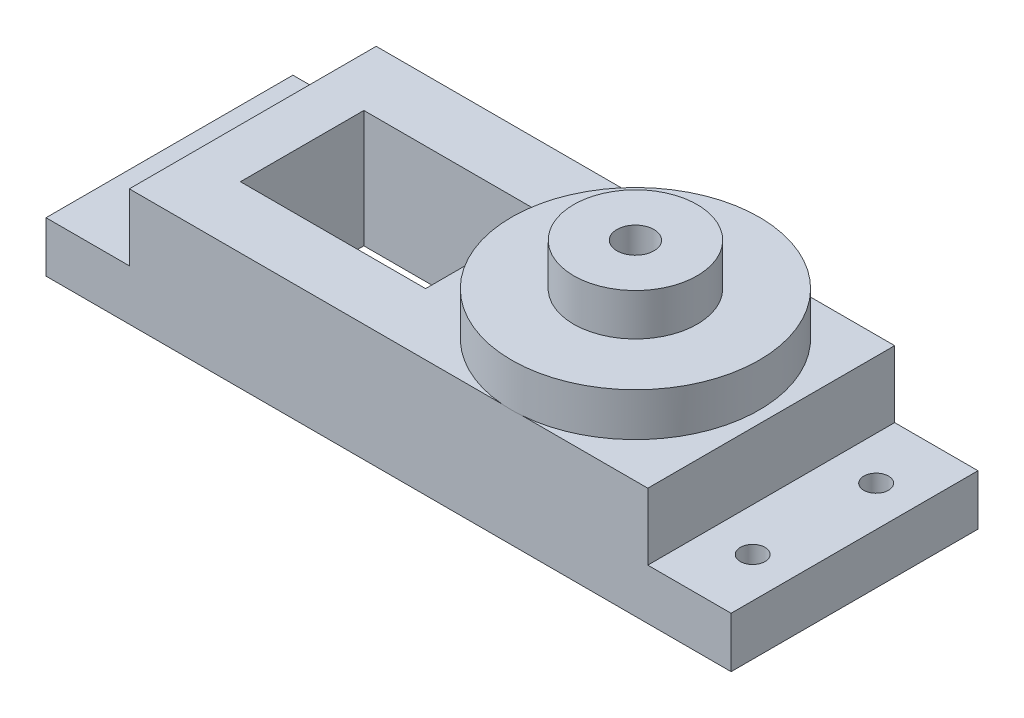
ISO-10303-21;
HEADER;
FILE_DESCRIPTION(('STEP AP214'),'2;1');
FILE_NAME('part.step','',(''),(''),'','','');
FILE_SCHEMA(('AUTOMOTIVE_DESIGN { 1 0 10303 214 1 1 1 1 }'));
ENDSEC;
DATA;
#1=APPLICATION_CONTEXT('core data for automotive mechanical design processes');
#2=APPLICATION_PROTOCOL_DEFINITION('international standard','automotive_design',2000,#1);
#3=PRODUCT_CONTEXT('',#1,'mechanical');
#4=PRODUCT('Part','Part','',(#3));
#5=PRODUCT_RELATED_PRODUCT_CATEGORY('part','',(#4));
#6=PRODUCT_DEFINITION_FORMATION('','',#4);
#7=PRODUCT_DEFINITION_CONTEXT('part definition',#1,'design');
#8=PRODUCT_DEFINITION('design','',#6,#7);
#9=PRODUCT_DEFINITION_SHAPE('','',#8);
#10=(LENGTH_UNIT() NAMED_UNIT(*) SI_UNIT(.MILLI.,.METRE.));
#11=(NAMED_UNIT(*) PLANE_ANGLE_UNIT() SI_UNIT($,.RADIAN.));
#12=(NAMED_UNIT(*) SI_UNIT($,.STERADIAN.) SOLID_ANGLE_UNIT());
#13=UNCERTAINTY_MEASURE_WITH_UNIT(LENGTH_MEASURE(1.E-05),#10,'distance_accuracy_value','');
#14=(GEOMETRIC_REPRESENTATION_CONTEXT(3) GLOBAL_UNCERTAINTY_ASSIGNED_CONTEXT((#13)) GLOBAL_UNIT_ASSIGNED_CONTEXT((#10,
#11,#12)) REPRESENTATION_CONTEXT('',''));
#15=CARTESIAN_POINT('',(0.,0.,0.));
#16=DIRECTION('',(0.,0.,1.));
#17=DIRECTION('',(1.,0.,0.));
#18=AXIS2_PLACEMENT_3D('',#15,#16,#17);
#19=CARTESIAN_POINT('',(9.50453806374918,13.,0.123865504954229));
#20=DIRECTION('',(0.,1.,0.));
#21=DIRECTION('',(0.,0.,1.));
#22=AXIS2_PLACEMENT_3D('',#19,#20,#21);
#23=PLANE('',#22);
#24=CARTESIAN_POINT('',(9.50453806374918,13.,0.123865504954229));
#25=DIRECTION('',(0.,1.,0.));
#26=DIRECTION('',(0.,0.,1.));
#27=AXIS2_PLACEMENT_3D('',#24,#25,#26);
#28=CIRCLE('',#27,10.0332233336355);
#29=CARTESIAN_POINT('',(9.50453806374918,13.,10.1570888385898));
#30=VERTEX_POINT('',#29);
#31=EDGE_CURVE('E175',#30,#30,#28,.T.);
#32=ORIENTED_EDGE('',*,*,#31,.T.);
#33=EDGE_LOOP('',(#32));
#34=FACE_BOUND('',#33,.T.);
#35=CARTESIAN_POINT('',(9.50453806374918,13.,0.123865504954229));
#36=DIRECTION('',(0.,1.,0.));
#37=DIRECTION('',(0.,0.,1.));
#38=AXIS2_PLACEMENT_3D('',#35,#36,#37);
#39=CIRCLE('',#38,5.);
#40=CARTESIAN_POINT('',(9.50453806374918,13.,5.12386550495423));
#41=VERTEX_POINT('',#40);
#42=EDGE_CURVE('E544',#41,#41,#39,.T.);
#43=ORIENTED_EDGE('',*,*,#42,.F.);
#44=EDGE_LOOP('',(#43));
#45=FACE_BOUND('',#44,.T.);
#46=ADVANCED_FACE('F39',(#34,#45),#23,.T.);
#47=CARTESIAN_POINT('',(0.,9.5,0.));
#48=DIRECTION('',(0.,1.,0.));
#49=DIRECTION('',(0.,0.,1.));
#50=AXIS2_PLACEMENT_3D('',#47,#48,#49);
#51=PLANE('',#50);
#52=CARTESIAN_POINT('',(9.50453806374918,9.5,0.123865504954229));
#53=DIRECTION('',(0.,1.,0.));
#54=DIRECTION('',(0.,0.,1.));
#55=AXIS2_PLACEMENT_3D('',#52,#53,#54);
#56=CIRCLE('',#55,10.0332233336355);
#57=CARTESIAN_POINT('',(10.320363204107,9.5,10.1238654951027));
#58=VERTEX_POINT('',#57);
#59=CARTESIAN_POINT('',(10.3203629625955,9.5,-9.87613450489733));
#60=VERTEX_POINT('',#59);
#61=EDGE_CURVE('E50',#58,#60,#56,.T.);
#62=ORIENTED_EDGE('',*,*,#61,.F.);
#63=DIRECTION('',(1.,0.,0.));
#64=VECTOR('',#63,1.);
#65=CARTESIAN_POINT('',(-21.4954619804107,9.5,10.1238654951027));
#66=LINE('',#65,#64);
#67=CARTESIAN_POINT('',(20.5045380195893,9.5,10.1238654951027));
#68=VERTEX_POINT('',#67);
#69=EDGE_CURVE('E154',#58,#68,#66,.T.);
#70=ORIENTED_EDGE('',*,*,#69,.T.);
#71=DIRECTION('',(0.,0.,-1.));
#72=VECTOR('',#71,1.);
#73=CARTESIAN_POINT('',(20.5045380195893,9.5,-9.87613450489733));
#74=LINE('',#73,#72);
#75=CARTESIAN_POINT('',(20.5045380195893,9.5,-9.87613450489733));
#76=VERTEX_POINT('',#75);
#77=EDGE_CURVE('E151',#68,#76,#74,.T.);
#78=ORIENTED_EDGE('',*,*,#77,.T.);
#79=DIRECTION('',(-1.,0.,0.));
#80=VECTOR('',#79,1.);
#81=CARTESIAN_POINT('',(-21.4954619804107,9.5,-9.87613450489733));
#82=LINE('',#81,#80);
#83=EDGE_CURVE('E202',#76,#60,#82,.T.);
#84=ORIENTED_EDGE('',*,*,#83,.T.);
#85=EDGE_LOOP('',(#62,#70,#78,#84));
#86=FACE_BOUND('',#85,.T.);
#87=ADVANCED_FACE('F381',(#86),#51,.T.);
#88=CARTESIAN_POINT('',(0.,4.1,0.));
#89=DIRECTION('',(0.,1.,0.));
#90=DIRECTION('',(0.,0.,1.));
#91=AXIS2_PLACEMENT_3D('',#88,#89,#90);
#92=PLANE('',#91);
#93=DIRECTION('',(0.,0.,1.));
#94=VECTOR('',#93,1.);
#95=CARTESIAN_POINT('',(-21.4954619804107,4.1,-9.87613450489733));
#96=LINE('',#95,#94);
#97=CARTESIAN_POINT('',(-21.4954619804107,4.1,-9.87613450489733));
#98=VERTEX_POINT('',#97);
#99=CARTESIAN_POINT('',(-21.4954619804107,4.1,10.1238654951027));
#100=VERTEX_POINT('',#99);
#101=EDGE_CURVE('E195',#98,#100,#96,.T.);
#102=ORIENTED_EDGE('',*,*,#101,.F.);
#103=DIRECTION('',(-1.,0.,0.));
#104=VECTOR('',#103,1.);
#105=CARTESIAN_POINT('',(-28.2454619804107,4.1,-9.87613450489733));
#106=LINE('',#105,#104);
#107=CARTESIAN_POINT('',(-28.2454619804107,4.1,-9.87613450489733));
#108=VERTEX_POINT('',#107);
#109=EDGE_CURVE('E305',#98,#108,#106,.T.);
#110=ORIENTED_EDGE('',*,*,#109,.T.);
#111=DIRECTION('',(0.,0.,1.));
#112=VECTOR('',#111,1.);
#113=CARTESIAN_POINT('',(-28.2454619804107,4.1,-9.87613450489733));
#114=LINE('',#113,#112);
#115=CARTESIAN_POINT('',(-28.2454619804107,4.1,10.1238654951027));
#116=VERTEX_POINT('',#115);
#117=EDGE_CURVE('E293',#108,#116,#114,.T.);
#118=ORIENTED_EDGE('',*,*,#117,.T.);
#119=DIRECTION('',(1.,0.,0.));
#120=VECTOR('',#119,1.);
#121=CARTESIAN_POINT('',(-28.2454619804107,4.1,10.1238654951027));
#122=LINE('',#121,#120);
#123=EDGE_CURVE('E299',#116,#100,#122,.T.);
#124=ORIENTED_EDGE('',*,*,#123,.T.);
#125=EDGE_LOOP('',(#102,#110,#118,#124));
#126=FACE_BOUND('',#125,.T.);
#127=CARTESIAN_POINT('',(-24.9954609110029,4.1,-4.87613408624877));
#128=DIRECTION('',(0.,1.,0.));
#129=DIRECTION('',(0.,0.,1.));
#130=AXIS2_PLACEMENT_3D('',#127,#128,#129);
#131=CIRCLE('',#130,1.00000022375208);
#132=CARTESIAN_POINT('',(-24.9954609110029,4.1,-3.87613386249669));
#133=VERTEX_POINT('',#132);
#134=EDGE_CURVE('E255',#133,#133,#131,.T.);
#135=ORIENTED_EDGE('',*,*,#134,.F.);
#136=EDGE_LOOP('',(#135));
#137=FACE_BOUND('',#136,.T.);
#138=CARTESIAN_POINT('',(-24.995461733564,4.1,5.12386549510267));
#139=DIRECTION('',(0.,1.,0.));
#140=DIRECTION('',(0.,0.,1.));
#141=AXIS2_PLACEMENT_3D('',#138,#139,#140);
#142=CIRCLE('',#141,1.00000006584271);
#143=CARTESIAN_POINT('',(-24.995461733564,4.1,6.12386556094537));
#144=VERTEX_POINT('',#143);
#145=EDGE_CURVE('E247',#144,#144,#142,.T.);
#146=ORIENTED_EDGE('',*,*,#145,.F.);
#147=EDGE_LOOP('',(#146));
#148=FACE_BOUND('',#147,.T.);
#149=ADVANCED_FACE('F386',(#126,#137,#148),#92,.T.);
#150=DIRECTION('',(0.,0.,-1.));
#151=VECTOR('',#150,1.);
#152=CARTESIAN_POINT('',(20.5045380195893,4.1,-9.87613450489733));
#153=LINE('',#152,#151);
#154=CARTESIAN_POINT('',(20.5045380195893,4.1,10.1238654951027));
#155=VERTEX_POINT('',#154);
#156=CARTESIAN_POINT('',(20.5045380195893,4.1,-9.87613450489733));
#157=VERTEX_POINT('',#156);
#158=EDGE_CURVE('E197',#155,#157,#153,.T.);
#159=ORIENTED_EDGE('',*,*,#158,.F.);
#160=CARTESIAN_POINT('',(27.2545380195893,4.1,10.1238654951027));
#161=VERTEX_POINT('',#160);
#162=EDGE_CURVE('E297',#155,#161,#122,.T.);
#163=ORIENTED_EDGE('',*,*,#162,.T.);
#164=DIRECTION('',(0.,0.,-1.));
#165=VECTOR('',#164,1.);
#166=CARTESIAN_POINT('',(27.2545380195893,4.1,-9.87613450489733));
#167=LINE('',#166,#165);
#168=CARTESIAN_POINT('',(27.2545380195893,4.1,-9.87613450489733));
#169=VERTEX_POINT('',#168);
#170=EDGE_CURVE('E302',#161,#169,#167,.T.);
#171=ORIENTED_EDGE('',*,*,#170,.T.);
#172=EDGE_CURVE('E306',#169,#157,#106,.T.);
#173=ORIENTED_EDGE('',*,*,#172,.T.);
#174=EDGE_LOOP('',(#159,#163,#171,#173));
#175=FACE_BOUND('',#174,.T.);
#176=CARTESIAN_POINT('',(24.0045387388948,4.1,-4.87613474736585));
#177=DIRECTION('',(0.,1.,0.));
#178=DIRECTION('',(0.,0.,1.));
#179=AXIS2_PLACEMENT_3D('',#176,#177,#178);
#180=CIRCLE('',#179,0.999999891208681);
#181=CARTESIAN_POINT('',(24.0045387388948,4.1,-3.87613485615717));
#182=VERTEX_POINT('',#181);
#183=EDGE_CURVE('E235',#182,#182,#180,.T.);
#184=ORIENTED_EDGE('',*,*,#183,.F.);
#185=EDGE_LOOP('',(#184));
#186=FACE_BOUND('',#185,.T.);
#187=CARTESIAN_POINT('',(24.0045376064598,4.1,5.12386541629419));
#188=DIRECTION('',(0.,1.,0.));
#189=DIRECTION('',(0.,0.,1.));
#190=AXIS2_PLACEMENT_3D('',#187,#188,#189);
#191=CIRCLE('',#190,0.999999586870481);
#192=CARTESIAN_POINT('',(24.0045376064598,4.1,6.12386500316467));
#193=VERTEX_POINT('',#192);
#194=EDGE_CURVE('E227',#193,#193,#191,.T.);
#195=ORIENTED_EDGE('',*,*,#194,.F.);
#196=EDGE_LOOP('',(#195));
#197=FACE_BOUND('',#196,.T.);
#198=ADVANCED_FACE('F351',(#175,#186,#197),#92,.T.);
#199=CARTESIAN_POINT('',(0.,0.,0.));
#200=DIRECTION('',(0.,1.,0.));
#201=DIRECTION('',(0.,0.,1.));
#202=AXIS2_PLACEMENT_3D('',#199,#200,#201);
#203=PLANE('',#202);
#204=DIRECTION('',(0.,0.,1.));
#205=VECTOR('',#204,1.);
#206=CARTESIAN_POINT('',(-28.2454619804107,0.,-9.87613450489733));
#207=LINE('',#206,#205);
#208=CARTESIAN_POINT('',(-28.2454619804107,0.,-9.87613450489733));
#209=VERTEX_POINT('',#208);
#210=CARTESIAN_POINT('',(-28.2454619804107,0.,10.1238654951027));
#211=VERTEX_POINT('',#210);
#212=EDGE_CURVE('E292',#209,#211,#207,.T.);
#213=ORIENTED_EDGE('',*,*,#212,.F.);
#214=DIRECTION('',(-1.,0.,0.));
#215=VECTOR('',#214,1.);
#216=CARTESIAN_POINT('',(-28.2454619804107,0.,-9.87613450489733));
#217=LINE('',#216,#215);
#218=CARTESIAN_POINT('',(27.2545380195893,0.,-9.87613450489733));
#219=VERTEX_POINT('',#218);
#220=EDGE_CURVE('E298',#219,#209,#217,.T.);
#221=ORIENTED_EDGE('',*,*,#220,.F.);
#222=DIRECTION('',(0.,0.,-1.));
#223=VECTOR('',#222,1.);
#224=CARTESIAN_POINT('',(27.2545380195893,0.,-9.87613450489733));
#225=LINE('',#224,#223);
#226=CARTESIAN_POINT('',(27.2545380195893,0.,10.1238654951027));
#227=VERTEX_POINT('',#226);
#228=EDGE_CURVE('E316',#227,#219,#225,.T.);
#229=ORIENTED_EDGE('',*,*,#228,.F.);
#230=DIRECTION('',(1.,0.,0.));
#231=VECTOR('',#230,1.);
#232=CARTESIAN_POINT('',(-28.2454619804107,0.,10.1238654951027));
#233=LINE('',#232,#231);
#234=EDGE_CURVE('E313',#211,#227,#233,.T.);
#235=ORIENTED_EDGE('',*,*,#234,.F.);
#236=EDGE_LOOP('',(#213,#221,#229,#235));
#237=FACE_BOUND('',#236,.T.);
#238=DIRECTION('',(0.,0.,1.));
#239=VECTOR('',#238,1.);
#240=CARTESIAN_POINT('',(-17.4954619804107,0.,-4.87613450489733));
#241=LINE('',#240,#239);
#242=CARTESIAN_POINT('',(-17.4954619804107,0.,-4.87613450489733));
#243=VERTEX_POINT('',#242);
#244=CARTESIAN_POINT('',(-17.4954619804107,0.,5.12386549510267));
#245=VERTEX_POINT('',#244);
#246=EDGE_CURVE('E259',#243,#245,#241,.T.);
#247=ORIENTED_EDGE('',*,*,#246,.T.);
#248=DIRECTION('',(1.,0.,0.));
#249=VECTOR('',#248,1.);
#250=CARTESIAN_POINT('',(-17.4954619804107,0.,5.12386549510267));
#251=LINE('',#250,#249);
#252=CARTESIAN_POINT('',(-2.49546198041067,0.,5.12386549510267));
#253=VERTEX_POINT('',#252);
#254=EDGE_CURVE('E266',#245,#253,#251,.T.);
#255=ORIENTED_EDGE('',*,*,#254,.T.);
#256=DIRECTION('',(0.,0.,-1.));
#257=VECTOR('',#256,1.);
#258=CARTESIAN_POINT('',(-2.49546198041067,0.,-4.87613450489733));
#259=LINE('',#258,#257);
#260=CARTESIAN_POINT('',(-2.49546198041067,0.,-4.87613450489733));
#261=VERTEX_POINT('',#260);
#262=EDGE_CURVE('E270',#253,#261,#259,.T.);
#263=ORIENTED_EDGE('',*,*,#262,.T.);
#264=DIRECTION('',(-1.,0.,0.));
#265=VECTOR('',#264,1.);
#266=CARTESIAN_POINT('',(-17.4954619804107,0.,-4.87613450489733));
#267=LINE('',#266,#265);
#268=EDGE_CURVE('E274',#261,#243,#267,.T.);
#269=ORIENTED_EDGE('',*,*,#268,.T.);
#270=EDGE_LOOP('',(#247,#255,#263,#269));
#271=FACE_BOUND('',#270,.T.);
#272=CARTESIAN_POINT('',(-24.9954609110029,0.,-4.87613408624877));
#273=DIRECTION('',(0.,1.,0.));
#274=DIRECTION('',(0.,0.,1.));
#275=AXIS2_PLACEMENT_3D('',#272,#273,#274);
#276=CIRCLE('',#275,1.00000022375208);
#277=CARTESIAN_POINT('',(-24.9954609110029,0.,-3.87613386249669));
#278=VERTEX_POINT('',#277);
#279=EDGE_CURVE('E251',#278,#278,#276,.T.);
#280=ORIENTED_EDGE('',*,*,#279,.T.);
#281=EDGE_LOOP('',(#280));
#282=FACE_BOUND('',#281,.T.);
#283=CARTESIAN_POINT('',(-24.995461733564,0.,5.12386549510267));
#284=DIRECTION('',(0.,1.,0.));
#285=DIRECTION('',(0.,0.,1.));
#286=AXIS2_PLACEMENT_3D('',#283,#284,#285);
#287=CIRCLE('',#286,1.00000006584271);
#288=CARTESIAN_POINT('',(-24.995461733564,0.,6.12386556094537));
#289=VERTEX_POINT('',#288);
#290=EDGE_CURVE('E246',#289,#289,#287,.T.);
#291=ORIENTED_EDGE('',*,*,#290,.T.);
#292=EDGE_LOOP('',(#291));
#293=FACE_BOUND('',#292,.T.);
#294=CARTESIAN_POINT('',(9.50453806374918,0.,0.123865504954229));
#295=DIRECTION('',(0.,1.,0.));
#296=DIRECTION('',(0.,0.,1.));
#297=AXIS2_PLACEMENT_3D('',#294,#295,#296);
#298=CIRCLE('',#297,1.50000002822516);
#299=CARTESIAN_POINT('',(9.50453806374918,0.,1.62386553317938));
#300=VERTEX_POINT('',#299);
#301=EDGE_CURVE('E239',#300,#300,#298,.T.);
#302=ORIENTED_EDGE('',*,*,#301,.T.);
#303=EDGE_LOOP('',(#302));
#304=FACE_BOUND('',#303,.T.);
#305=CARTESIAN_POINT('',(24.0045387388948,0.,-4.87613474736585));
#306=DIRECTION('',(0.,1.,0.));
#307=DIRECTION('',(0.,0.,1.));
#308=AXIS2_PLACEMENT_3D('',#305,#306,#307);
#309=CIRCLE('',#308,0.999999891208681);
#310=CARTESIAN_POINT('',(24.0045387388948,0.,-3.87613485615717));
#311=VERTEX_POINT('',#310);
#312=EDGE_CURVE('E231',#311,#311,#309,.T.);
#313=ORIENTED_EDGE('',*,*,#312,.T.);
#314=EDGE_LOOP('',(#313));
#315=FACE_BOUND('',#314,.T.);
#316=CARTESIAN_POINT('',(24.0045376064598,0.,5.12386541629419));
#317=DIRECTION('',(0.,1.,0.));
#318=DIRECTION('',(0.,0.,1.));
#319=AXIS2_PLACEMENT_3D('',#316,#317,#318);
#320=CIRCLE('',#319,0.999999586870481);
#321=CARTESIAN_POINT('',(24.0045376064598,0.,6.12386500316467));
#322=VERTEX_POINT('',#321);
#323=EDGE_CURVE('E226',#322,#322,#320,.T.);
#324=ORIENTED_EDGE('',*,*,#323,.T.);
#325=EDGE_LOOP('',(#324));
#326=FACE_BOUND('',#325,.T.);
#327=ADVANCED_FACE('F343',(#237,#271,#282,#293,#304,#315,#326),#203,.F.);
#328=CARTESIAN_POINT('',(-28.2454619804107,4.1,-9.87613450489733));
#329=DIRECTION('',(1.,0.,0.));
#330=DIRECTION('',(0.,0.,-1.));
#331=AXIS2_PLACEMENT_3D('',#328,#329,#330);
#332=PLANE('',#331);
#333=ORIENTED_EDGE('',*,*,#212,.T.);
#334=DIRECTION('',(0.,-1.,0.));
#335=VECTOR('',#334,1.);
#336=CARTESIAN_POINT('',(-28.2454619804107,4.1,10.1238654951027));
#337=LINE('',#336,#335);
#338=EDGE_CURVE('E43',#116,#211,#337,.T.);
#339=ORIENTED_EDGE('',*,*,#338,.F.);
#340=ORIENTED_EDGE('',*,*,#117,.F.);
#341=DIRECTION('',(0.,-1.,0.));
#342=VECTOR('',#341,1.);
#343=CARTESIAN_POINT('',(-28.2454619804107,4.1,-9.87613450489733));
#344=LINE('',#343,#342);
#345=EDGE_CURVE('E309',#108,#209,#344,.T.);
#346=ORIENTED_EDGE('',*,*,#345,.T.);
#347=EDGE_LOOP('',(#333,#339,#340,#346));
#348=FACE_BOUND('',#347,.T.);
#349=ADVANCED_FACE('F41',(#348),#332,.F.);
#350=CARTESIAN_POINT('',(-28.2454619804107,4.1,10.1238654951027));
#351=DIRECTION('',(0.,0.,-1.));
#352=DIRECTION('',(-1.,0.,0.));
#353=AXIS2_PLACEMENT_3D('',#350,#351,#352);
#354=PLANE('',#353);
#355=ORIENTED_EDGE('',*,*,#234,.T.);
#356=DIRECTION('',(0.,-1.,0.));
#357=VECTOR('',#356,1.);
#358=CARTESIAN_POINT('',(27.2545380195893,4.1,10.1238654951027));
#359=LINE('',#358,#357);
#360=EDGE_CURVE('E327',#161,#227,#359,.T.);
#361=ORIENTED_EDGE('',*,*,#360,.F.);
#362=ORIENTED_EDGE('',*,*,#162,.F.);
#363=DIRECTION('',(0.,-1.,0.));
#364=VECTOR('',#363,1.);
#365=CARTESIAN_POINT('',(20.5045380195893,9.5,10.1238654951027));
#366=LINE('',#365,#364);
#367=EDGE_CURVE('E219',#68,#155,#366,.T.);
#368=ORIENTED_EDGE('',*,*,#367,.F.);
#369=ORIENTED_EDGE('',*,*,#69,.F.);
#370=CARTESIAN_POINT('',(8.68871292339131,9.5,10.1238654951027));
#371=VERTEX_POINT('',#370);
#372=EDGE_CURVE('E152',#371,#58,#66,.T.);
#373=ORIENTED_EDGE('',*,*,#372,.F.);
#374=CARTESIAN_POINT('',(-21.4954619804107,9.5,10.1238654951027));
#375=VERTEX_POINT('',#374);
#376=EDGE_CURVE('E141',#375,#371,#66,.T.);
#377=ORIENTED_EDGE('',*,*,#376,.F.);
#378=DIRECTION('',(0.,-1.,0.));
#379=VECTOR('',#378,1.);
#380=CARTESIAN_POINT('',(-21.4954619804107,9.5,10.1238654951027));
#381=LINE('',#380,#379);
#382=EDGE_CURVE('E223',#375,#100,#381,.T.);
#383=ORIENTED_EDGE('',*,*,#382,.T.);
#384=ORIENTED_EDGE('',*,*,#123,.F.);
#385=ORIENTED_EDGE('',*,*,#338,.T.);
#386=EDGE_LOOP('',(#355,#361,#362,#368,#369,#373,#377,#383,#384,#385));
#387=FACE_BOUND('',#386,.T.);
#388=ADVANCED_FACE('F158',(#387),#354,.F.);
#389=CARTESIAN_POINT('',(27.2545380195893,4.1,-9.87613450489733));
#390=DIRECTION('',(-1.,0.,0.));
#391=DIRECTION('',(0.,0.,1.));
#392=AXIS2_PLACEMENT_3D('',#389,#390,#391);
#393=PLANE('',#392);
#394=ORIENTED_EDGE('',*,*,#228,.T.);
#395=DIRECTION('',(0.,-1.,0.));
#396=VECTOR('',#395,1.);
#397=CARTESIAN_POINT('',(27.2545380195893,4.1,-9.87613450489733));
#398=LINE('',#397,#396);
#399=EDGE_CURVE('E324',#169,#219,#398,.T.);
#400=ORIENTED_EDGE('',*,*,#399,.F.);
#401=ORIENTED_EDGE('',*,*,#170,.F.);
#402=ORIENTED_EDGE('',*,*,#360,.T.);
#403=EDGE_LOOP('',(#394,#400,#401,#402));
#404=FACE_BOUND('',#403,.T.);
#405=ADVANCED_FACE('F346',(#404),#393,.F.);
#406=CARTESIAN_POINT('',(-28.2454619804107,4.1,-9.87613450489733));
#407=DIRECTION('',(0.,0.,1.));
#408=DIRECTION('',(1.,0.,0.));
#409=AXIS2_PLACEMENT_3D('',#406,#407,#408);
#410=PLANE('',#409);
#411=ORIENTED_EDGE('',*,*,#220,.T.);
#412=ORIENTED_EDGE('',*,*,#345,.F.);
#413=ORIENTED_EDGE('',*,*,#109,.F.);
#414=DIRECTION('',(0.,-1.,0.));
#415=VECTOR('',#414,1.);
#416=CARTESIAN_POINT('',(-21.4954619804107,9.5,-9.87613450489733));
#417=LINE('',#416,#415);
#418=CARTESIAN_POINT('',(-21.4954619804107,9.5,-9.87613450489733));
#419=VERTEX_POINT('',#418);
#420=EDGE_CURVE('E205',#419,#98,#417,.T.);
#421=ORIENTED_EDGE('',*,*,#420,.F.);
#422=CARTESIAN_POINT('',(8.68871316490289,9.5,-9.87613450489733));
#423=VERTEX_POINT('',#422);
#424=EDGE_CURVE('E201',#423,#419,#82,.T.);
#425=ORIENTED_EDGE('',*,*,#424,.F.);
#426=EDGE_CURVE('E63',#60,#423,#82,.T.);
#427=ORIENTED_EDGE('',*,*,#426,.F.);
#428=ORIENTED_EDGE('',*,*,#83,.F.);
#429=DIRECTION('',(0.,-1.,0.));
#430=VECTOR('',#429,1.);
#431=CARTESIAN_POINT('',(20.5045380195893,9.5,-9.87613450489733));
#432=LINE('',#431,#430);
#433=EDGE_CURVE('E215',#76,#157,#432,.T.);
#434=ORIENTED_EDGE('',*,*,#433,.T.);
#435=ORIENTED_EDGE('',*,*,#172,.F.);
#436=ORIENTED_EDGE('',*,*,#399,.T.);
#437=EDGE_LOOP('',(#411,#412,#413,#421,#425,#427,#428,#434,#435,#436));
#438=FACE_BOUND('',#437,.T.);
#439=ADVANCED_FACE('F348',(#438),#410,.F.);
#440=CARTESIAN_POINT('',(-17.4954619804107,4.1,-4.87613450489733));
#441=DIRECTION('',(1.,0.,0.));
#442=DIRECTION('',(0.,0.,-1.));
#443=AXIS2_PLACEMENT_3D('',#440,#441,#442);
#444=PLANE('',#443);
#445=ORIENTED_EDGE('',*,*,#246,.F.);
#446=DIRECTION('',(0.,-1.,0.));
#447=VECTOR('',#446,1.);
#448=CARTESIAN_POINT('',(-17.4954619804107,4.1,-4.87613450489733));
#449=LINE('',#448,#447);
#450=CARTESIAN_POINT('',(-17.4954619804107,9.5,-4.87613450489733));
#451=VERTEX_POINT('',#450);
#452=EDGE_CURVE('E278',#451,#243,#449,.T.);
#453=ORIENTED_EDGE('',*,*,#452,.F.);
#454=DIRECTION('',(0.,0.,1.));
#455=VECTOR('',#454,1.);
#456=CARTESIAN_POINT('',(-17.4954619804107,9.5,-4.87613450489733));
#457=LINE('',#456,#455);
#458=CARTESIAN_POINT('',(-17.4954619804107,9.5,5.12386549510267));
#459=VERTEX_POINT('',#458);
#460=EDGE_CURVE('E179',#451,#459,#457,.T.);
#461=ORIENTED_EDGE('',*,*,#460,.T.);
#462=DIRECTION('',(0.,-1.,0.));
#463=VECTOR('',#462,1.);
#464=CARTESIAN_POINT('',(-17.4954619804107,4.1,5.12386549510267));
#465=LINE('',#464,#463);
#466=EDGE_CURVE('E288',#459,#245,#465,.T.);
#467=ORIENTED_EDGE('',*,*,#466,.T.);
#468=EDGE_LOOP('',(#445,#453,#461,#467));
#469=FACE_BOUND('',#468,.T.);
#470=ADVANCED_FACE('F432',(#469),#444,.T.);
#471=CARTESIAN_POINT('',(-17.4954619804107,4.1,5.12386549510267));
#472=DIRECTION('',(0.,0.,-1.));
#473=DIRECTION('',(-1.,0.,0.));
#474=AXIS2_PLACEMENT_3D('',#471,#472,#473);
#475=PLANE('',#474);
#476=ORIENTED_EDGE('',*,*,#254,.F.);
#477=ORIENTED_EDGE('',*,*,#466,.F.);
#478=DIRECTION('',(1.,0.,0.));
#479=VECTOR('',#478,1.);
#480=CARTESIAN_POINT('',(-17.4954619804107,9.5,5.12386549510267));
#481=LINE('',#480,#479);
#482=CARTESIAN_POINT('',(-2.49546198041067,9.5,5.12386549510267));
#483=VERTEX_POINT('',#482);
#484=EDGE_CURVE('E183',#459,#483,#481,.T.);
#485=ORIENTED_EDGE('',*,*,#484,.T.);
#486=DIRECTION('',(0.,-1.,0.));
#487=VECTOR('',#486,1.);
#488=CARTESIAN_POINT('',(-2.49546198041067,4.1,5.12386549510267));
#489=LINE('',#488,#487);
#490=EDGE_CURVE('E285',#483,#253,#489,.T.);
#491=ORIENTED_EDGE('',*,*,#490,.T.);
#492=EDGE_LOOP('',(#476,#477,#485,#491));
#493=FACE_BOUND('',#492,.T.);
#494=ADVANCED_FACE('F428',(#493),#475,.T.);
#495=CARTESIAN_POINT('',(-2.49546198041067,4.1,-4.87613450489733));
#496=DIRECTION('',(-1.,0.,0.));
#497=DIRECTION('',(0.,0.,1.));
#498=AXIS2_PLACEMENT_3D('',#495,#496,#497);
#499=PLANE('',#498);
#500=ORIENTED_EDGE('',*,*,#262,.F.);
#501=ORIENTED_EDGE('',*,*,#490,.F.);
#502=DIRECTION('',(0.,0.,-1.));
#503=VECTOR('',#502,1.);
#504=CARTESIAN_POINT('',(-2.49546198041067,9.5,-4.87613450489733));
#505=LINE('',#504,#503);
#506=CARTESIAN_POINT('',(-2.49546198041067,9.5,-4.87613450489733));
#507=VERTEX_POINT('',#506);
#508=EDGE_CURVE('E187',#483,#507,#505,.T.);
#509=ORIENTED_EDGE('',*,*,#508,.T.);
#510=DIRECTION('',(0.,-1.,0.));
#511=VECTOR('',#510,1.);
#512=CARTESIAN_POINT('',(-2.49546198041067,4.1,-4.87613450489733));
#513=LINE('',#512,#511);
#514=EDGE_CURVE('E282',#507,#261,#513,.T.);
#515=ORIENTED_EDGE('',*,*,#514,.T.);
#516=EDGE_LOOP('',(#500,#501,#509,#515));
#517=FACE_BOUND('',#516,.T.);
#518=ADVANCED_FACE('F424',(#517),#499,.T.);
#519=CARTESIAN_POINT('',(-17.4954619804107,4.1,-4.87613450489733));
#520=DIRECTION('',(0.,0.,1.));
#521=DIRECTION('',(1.,0.,0.));
#522=AXIS2_PLACEMENT_3D('',#519,#520,#521);
#523=PLANE('',#522);
#524=ORIENTED_EDGE('',*,*,#268,.F.);
#525=ORIENTED_EDGE('',*,*,#514,.F.);
#526=DIRECTION('',(-1.,0.,0.));
#527=VECTOR('',#526,1.);
#528=CARTESIAN_POINT('',(-17.4954619804107,9.5,-4.87613450489733));
#529=LINE('',#528,#527);
#530=EDGE_CURVE('E191',#507,#451,#529,.T.);
#531=ORIENTED_EDGE('',*,*,#530,.T.);
#532=ORIENTED_EDGE('',*,*,#452,.T.);
#533=EDGE_LOOP('',(#524,#525,#531,#532));
#534=FACE_BOUND('',#533,.T.);
#535=ADVANCED_FACE('F420',(#534),#523,.T.);
#536=CARTESIAN_POINT('',(-24.9954609110029,4.1,-4.87613408624877));
#537=DIRECTION('',(0.,-1.,0.));
#538=DIRECTION('',(0.,0.,-1.));
#539=AXIS2_PLACEMENT_3D('',#536,#537,#538);
#540=CYLINDRICAL_SURFACE('',#539,1.00000022375208);
#541=ORIENTED_EDGE('',*,*,#134,.T.);
#542=EDGE_LOOP('',(#541));
#543=FACE_BOUND('',#542,.T.);
#544=ORIENTED_EDGE('',*,*,#279,.F.);
#545=EDGE_LOOP('',(#544));
#546=FACE_BOUND('',#545,.T.);
#547=ADVANCED_FACE('F416',(#543,#546),#540,.F.);
#548=CARTESIAN_POINT('',(-24.995461733564,4.1,5.12386549510267));
#549=DIRECTION('',(0.,-1.,0.));
#550=DIRECTION('',(0.,0.,-1.));
#551=AXIS2_PLACEMENT_3D('',#548,#549,#550);
#552=CYLINDRICAL_SURFACE('',#551,1.00000006584271);
#553=ORIENTED_EDGE('',*,*,#145,.T.);
#554=EDGE_LOOP('',(#553));
#555=FACE_BOUND('',#554,.T.);
#556=ORIENTED_EDGE('',*,*,#290,.F.);
#557=EDGE_LOOP('',(#556));
#558=FACE_BOUND('',#557,.T.);
#559=ADVANCED_FACE('F412',(#555,#558),#552,.F.);
#560=CARTESIAN_POINT('',(9.50453806374918,4.1,0.123865504954229));
#561=DIRECTION('',(0.,-1.,0.));
#562=DIRECTION('',(0.,0.,-1.));
#563=AXIS2_PLACEMENT_3D('',#560,#561,#562);
#564=CYLINDRICAL_SURFACE('',#563,1.50000002822516);
#565=ORIENTED_EDGE('',*,*,#301,.F.);
#566=EDGE_LOOP('',(#565));
#567=FACE_BOUND('',#566,.T.);
#568=CARTESIAN_POINT('',(9.50453806374918,16.4,0.123865504954229));
#569=DIRECTION('',(0.,1.,0.));
#570=DIRECTION('',(0.,0.,1.));
#571=AXIS2_PLACEMENT_3D('',#568,#569,#570);
#572=CIRCLE('',#571,1.50000002822516);
#573=CARTESIAN_POINT('',(9.50453806374918,16.4,1.62386553317938));
#574=VERTEX_POINT('',#573);
#575=EDGE_CURVE('E546',#574,#574,#572,.T.);
#576=ORIENTED_EDGE('',*,*,#575,.T.);
#577=EDGE_LOOP('',(#576));
#578=FACE_BOUND('',#577,.T.);
#579=ADVANCED_FACE('F408',(#567,#578),#564,.F.);
#580=CARTESIAN_POINT('',(24.0045387388948,4.1,-4.87613474736585));
#581=DIRECTION('',(0.,-1.,0.));
#582=DIRECTION('',(0.,0.,-1.));
#583=AXIS2_PLACEMENT_3D('',#580,#581,#582);
#584=CYLINDRICAL_SURFACE('',#583,0.999999891208681);
#585=ORIENTED_EDGE('',*,*,#183,.T.);
#586=EDGE_LOOP('',(#585));
#587=FACE_BOUND('',#586,.T.);
#588=ORIENTED_EDGE('',*,*,#312,.F.);
#589=EDGE_LOOP('',(#588));
#590=FACE_BOUND('',#589,.T.);
#591=ADVANCED_FACE('F404',(#587,#590),#584,.F.);
#592=CARTESIAN_POINT('',(24.0045376064598,4.1,5.12386541629419));
#593=DIRECTION('',(0.,-1.,0.));
#594=DIRECTION('',(0.,0.,-1.));
#595=AXIS2_PLACEMENT_3D('',#592,#593,#594);
#596=CYLINDRICAL_SURFACE('',#595,0.999999586870481);
#597=ORIENTED_EDGE('',*,*,#194,.T.);
#598=EDGE_LOOP('',(#597));
#599=FACE_BOUND('',#598,.T.);
#600=ORIENTED_EDGE('',*,*,#323,.F.);
#601=EDGE_LOOP('',(#600));
#602=FACE_BOUND('',#601,.T.);
#603=ADVANCED_FACE('F401',(#599,#602),#596,.F.);
#604=EDGE_CURVE('E11',#423,#371,#56,.T.);
#605=ORIENTED_EDGE('',*,*,#604,.F.);
#606=ORIENTED_EDGE('',*,*,#424,.T.);
#607=DIRECTION('',(0.,0.,1.));
#608=VECTOR('',#607,1.);
#609=CARTESIAN_POINT('',(-21.4954619804107,9.5,-9.87613450489733));
#610=LINE('',#609,#608);
#611=EDGE_CURVE('E146',#419,#375,#610,.T.);
#612=ORIENTED_EDGE('',*,*,#611,.T.);
#613=ORIENTED_EDGE('',*,*,#376,.T.);
#614=EDGE_LOOP('',(#605,#606,#612,#613));
#615=FACE_BOUND('',#614,.T.);
#616=ORIENTED_EDGE('',*,*,#484,.F.);
#617=ORIENTED_EDGE('',*,*,#460,.F.);
#618=ORIENTED_EDGE('',*,*,#530,.F.);
#619=ORIENTED_EDGE('',*,*,#508,.F.);
#620=EDGE_LOOP('',(#616,#617,#618,#619));
#621=FACE_BOUND('',#620,.T.);
#622=ADVANCED_FACE('F143',(#615,#621),#51,.T.);
#623=CARTESIAN_POINT('',(-21.4954619804107,9.5,-9.87613450489733));
#624=DIRECTION('',(1.,0.,0.));
#625=DIRECTION('',(0.,0.,-1.));
#626=AXIS2_PLACEMENT_3D('',#623,#624,#625);
#627=PLANE('',#626);
#628=ORIENTED_EDGE('',*,*,#101,.T.);
#629=ORIENTED_EDGE('',*,*,#382,.F.);
#630=ORIENTED_EDGE('',*,*,#611,.F.);
#631=ORIENTED_EDGE('',*,*,#420,.T.);
#632=EDGE_LOOP('',(#628,#629,#630,#631));
#633=FACE_BOUND('',#632,.T.);
#634=ADVANCED_FACE('F393',(#633),#627,.F.);
#635=CARTESIAN_POINT('',(20.5045380195893,9.5,-9.87613450489733));
#636=DIRECTION('',(-1.,0.,0.));
#637=DIRECTION('',(0.,0.,1.));
#638=AXIS2_PLACEMENT_3D('',#635,#636,#637);
#639=PLANE('',#638);
#640=ORIENTED_EDGE('',*,*,#158,.T.);
#641=ORIENTED_EDGE('',*,*,#433,.F.);
#642=ORIENTED_EDGE('',*,*,#77,.F.);
#643=ORIENTED_EDGE('',*,*,#367,.T.);
#644=EDGE_LOOP('',(#640,#641,#642,#643));
#645=FACE_BOUND('',#644,.T.);
#646=ADVANCED_FACE('F355',(#645),#639,.F.);
#647=CARTESIAN_POINT('',(9.50453806374918,9.5,0.123865504954229));
#648=DIRECTION('',(0.,1.,0.));
#649=DIRECTION('',(0.,0.,1.));
#650=AXIS2_PLACEMENT_3D('',#647,#648,#649);
#651=PLANE('',#650);
#652=EDGE_CURVE('E163',#371,#58,#56,.T.);
#653=ORIENTED_EDGE('',*,*,#652,.F.);
#654=ORIENTED_EDGE('',*,*,#372,.T.);
#655=EDGE_LOOP('',(#653,#654));
#656=FACE_BOUND('',#655,.T.);
#657=ADVANCED_FACE('F164',(#656),#651,.F.);
#658=EDGE_CURVE('E51',#60,#423,#56,.T.);
#659=ORIENTED_EDGE('',*,*,#658,.F.);
#660=ORIENTED_EDGE('',*,*,#426,.T.);
#661=EDGE_LOOP('',(#659,#660));
#662=FACE_BOUND('',#661,.T.);
#663=ADVANCED_FACE('F369',(#662),#651,.F.);
#664=CARTESIAN_POINT('',(9.50453806374918,13.,0.123865504954229));
#665=DIRECTION('',(0.,-1.,0.));
#666=DIRECTION('',(0.,0.,-1.));
#667=AXIS2_PLACEMENT_3D('',#664,#665,#666);
#668=CYLINDRICAL_SURFACE('',#667,10.0332233336355);
#669=ORIENTED_EDGE('',*,*,#31,.F.);
#670=EDGE_LOOP('',(#669));
#671=FACE_BOUND('',#670,.T.);
#672=ORIENTED_EDGE('',*,*,#61,.T.);
#673=ORIENTED_EDGE('',*,*,#658,.T.);
#674=ORIENTED_EDGE('',*,*,#604,.T.);
#675=ORIENTED_EDGE('',*,*,#652,.T.);
#676=EDGE_LOOP('',(#672,#673,#674,#675));
#677=FACE_BOUND('',#676,.T.);
#678=ADVANCED_FACE('F170',(#671,#677),#668,.T.);
#679=CARTESIAN_POINT('',(9.50453806374918,16.4,0.123865504954229));
#680=DIRECTION('',(0.,1.,0.));
#681=DIRECTION('',(0.,0.,1.));
#682=AXIS2_PLACEMENT_3D('',#679,#680,#681);
#683=PLANE('',#682);
#684=CARTESIAN_POINT('',(9.50453806374918,16.4,0.123865504954229));
#685=DIRECTION('',(0.,1.,0.));
#686=DIRECTION('',(0.,0.,1.));
#687=AXIS2_PLACEMENT_3D('',#684,#685,#686);
#688=CIRCLE('',#687,5.);
#689=CARTESIAN_POINT('',(9.50453806374918,16.4,5.12386550495423));
#690=VERTEX_POINT('',#689);
#691=EDGE_CURVE('E168',#690,#690,#688,.T.);
#692=ORIENTED_EDGE('',*,*,#691,.T.);
#693=EDGE_LOOP('',(#692));
#694=FACE_BOUND('',#693,.T.);
#695=ORIENTED_EDGE('',*,*,#575,.F.);
#696=EDGE_LOOP('',(#695));
#697=FACE_BOUND('',#696,.T.);
#698=ADVANCED_FACE('F368',(#694,#697),#683,.T.);
#699=CARTESIAN_POINT('',(9.50453806374918,16.4,0.123865504954229));
#700=DIRECTION('',(0.,-1.,0.));
#701=DIRECTION('',(0.,0.,-1.));
#702=AXIS2_PLACEMENT_3D('',#699,#700,#701);
#703=CYLINDRICAL_SURFACE('',#702,5.);
#704=ORIENTED_EDGE('',*,*,#691,.F.);
#705=EDGE_LOOP('',(#704));
#706=FACE_BOUND('',#705,.T.);
#707=ORIENTED_EDGE('',*,*,#42,.T.);
#708=EDGE_LOOP('',(#707));
#709=FACE_BOUND('',#708,.T.);
#710=ADVANCED_FACE('F375',(#706,#709),#703,.T.);
#711=CLOSED_SHELL('',(#46,#87,#149,#198,#327,#349,#388,#405,#439,#470,#494,#518,#535,#547,#559,
#579,#591,#603,#622,#634,#646,#657,#663,#678,#698,#710));
#712=MANIFOLD_SOLID_BREP('B2',#711);
#713=ADVANCED_BREP_SHAPE_REPRESENTATION('',(#18,#712),#14);
#714=SHAPE_DEFINITION_REPRESENTATION(#9,#713);
ENDSEC;
END-ISO-10303-21;
